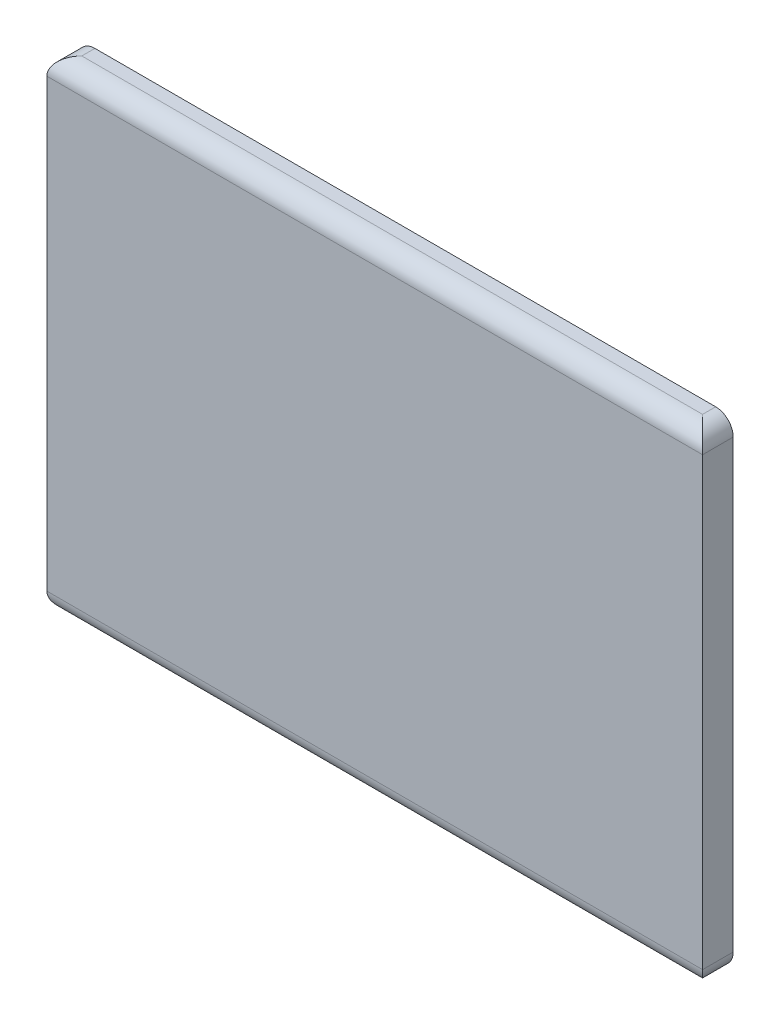
ISO-10303-21;
HEADER;
FILE_DESCRIPTION(('STEP AP214'),'2;1');
FILE_NAME('part.step','',(''),(''),'','','');
FILE_SCHEMA(('AUTOMOTIVE_DESIGN { 1 0 10303 214 1 1 1 1 }'));
ENDSEC;
DATA;
#1=APPLICATION_CONTEXT('core data for automotive mechanical design processes');
#2=APPLICATION_PROTOCOL_DEFINITION('international standard','automotive_design',2000,#1);
#3=PRODUCT_CONTEXT('',#1,'mechanical');
#4=PRODUCT('Part','Part','',(#3));
#5=PRODUCT_RELATED_PRODUCT_CATEGORY('part','',(#4));
#6=PRODUCT_DEFINITION_FORMATION('','',#4);
#7=PRODUCT_DEFINITION_CONTEXT('part definition',#1,'design');
#8=PRODUCT_DEFINITION('design','',#6,#7);
#9=PRODUCT_DEFINITION_SHAPE('','',#8);
#10=(LENGTH_UNIT() NAMED_UNIT(*) SI_UNIT(.MILLI.,.METRE.));
#11=(NAMED_UNIT(*) PLANE_ANGLE_UNIT() SI_UNIT($,.RADIAN.));
#12=(NAMED_UNIT(*) SI_UNIT($,.STERADIAN.) SOLID_ANGLE_UNIT());
#13=UNCERTAINTY_MEASURE_WITH_UNIT(LENGTH_MEASURE(1.E-05),#10,'distance_accuracy_value','');
#14=(GEOMETRIC_REPRESENTATION_CONTEXT(3) GLOBAL_UNCERTAINTY_ASSIGNED_CONTEXT((#13)) GLOBAL_UNIT_ASSIGNED_CONTEXT((#10,
#11,#12)) REPRESENTATION_CONTEXT('',''));
#15=CARTESIAN_POINT('',(0.,0.,0.));
#16=DIRECTION('',(0.,0.,1.));
#17=DIRECTION('',(1.,0.,0.));
#18=AXIS2_PLACEMENT_3D('',#15,#16,#17);
#19=CARTESIAN_POINT('',(0.,0.55,0.));
#20=DIRECTION('',(0.,1.,0.));
#21=DIRECTION('',(1.,0.,0.));
#22=AXIS2_PLACEMENT_3D('',#19,#20,#21);
#23=PLANE('',#22);
#24=DIRECTION('',(0.,0.,1.));
#25=VECTOR('',#24,1.);
#26=CARTESIAN_POINT('',(0.73,0.55,0.));
#27=LINE('',#26,#25);
#28=CARTESIAN_POINT('',(0.73,0.55,0.));
#29=VERTEX_POINT('',#28);
#30=CARTESIAN_POINT('',(0.73,0.55,0.015));
#31=VERTEX_POINT('',#30);
#32=EDGE_CURVE('E161',#29,#31,#27,.T.);
#33=ORIENTED_EDGE('',*,*,#32,.F.);
#34=DIRECTION('',(1.,0.,0.));
#35=VECTOR('',#34,1.);
#36=CARTESIAN_POINT('',(0.,0.55,0.));
#37=LINE('',#36,#35);
#38=CARTESIAN_POINT('',(0.02,0.55,0.));
#39=VERTEX_POINT('',#38);
#40=EDGE_CURVE('E11',#39,#29,#37,.T.);
#41=ORIENTED_EDGE('',*,*,#40,.F.);
#42=DIRECTION('',(0.,0.,-1.));
#43=VECTOR('',#42,1.);
#44=CARTESIAN_POINT('',(0.02,0.55,0.));
#45=LINE('',#44,#43);
#46=CARTESIAN_POINT('',(0.02,0.55,0.015));
#47=VERTEX_POINT('',#46);
#48=EDGE_CURVE('E197',#47,#39,#45,.T.);
#49=ORIENTED_EDGE('',*,*,#48,.F.);
#50=DIRECTION('',(-1.,0.,0.));
#51=VECTOR('',#50,1.);
#52=CARTESIAN_POINT('',(0.,0.55,0.015));
#53=LINE('',#52,#51);
#54=EDGE_CURVE('E146',#31,#47,#53,.T.);
#55=ORIENTED_EDGE('',*,*,#54,.F.);
#56=EDGE_LOOP('',(#33,#41,#49,#55));
#57=FACE_BOUND('',#56,.T.);
#58=ADVANCED_FACE('F17',(#57),#23,.T.);
#59=CARTESIAN_POINT('',(0.,0.,0.));
#60=DIRECTION('',(0.,0.,1.));
#61=DIRECTION('',(1.,0.,0.));
#62=AXIS2_PLACEMENT_3D('',#59,#60,#61);
#63=PLANE('',#62);
#64=CARTESIAN_POINT('',(0.73,0.53,0.));
#65=DIRECTION('',(0.,0.,1.));
#66=DIRECTION('',(0.707106781186548,0.707106781186548,0.));
#67=AXIS2_PLACEMENT_3D('',#64,#65,#66);
#68=CIRCLE('',#67,0.02);
#69=CARTESIAN_POINT('',(0.75,0.53,0.));
#70=VERTEX_POINT('',#69);
#71=EDGE_CURVE('E127',#70,#29,#68,.T.);
#72=ORIENTED_EDGE('',*,*,#71,.F.);
#73=DIRECTION('',(0.,1.,0.));
#74=VECTOR('',#73,1.);
#75=CARTESIAN_POINT('',(0.75,0.,0.));
#76=LINE('',#75,#74);
#77=CARTESIAN_POINT('',(0.75,0.02,0.));
#78=VERTEX_POINT('',#77);
#79=EDGE_CURVE('E69',#78,#70,#76,.T.);
#80=ORIENTED_EDGE('',*,*,#79,.F.);
#81=CARTESIAN_POINT('',(0.73,0.02,0.));
#82=DIRECTION('',(0.,0.,1.));
#83=DIRECTION('',(0.707106781186548,-0.707106781186547,0.));
#84=AXIS2_PLACEMENT_3D('',#81,#82,#83);
#85=CIRCLE('',#84,0.02);
#86=CARTESIAN_POINT('',(0.73,0.,0.));
#87=VERTEX_POINT('',#86);
#88=EDGE_CURVE('E118',#87,#78,#85,.T.);
#89=ORIENTED_EDGE('',*,*,#88,.F.);
#90=DIRECTION('',(1.,0.,0.));
#91=VECTOR('',#90,1.);
#92=CARTESIAN_POINT('',(0.,0.,0.));
#93=LINE('',#92,#91);
#94=CARTESIAN_POINT('',(0.02,0.,0.));
#95=VERTEX_POINT('',#94);
#96=EDGE_CURVE('E28',#95,#87,#93,.T.);
#97=ORIENTED_EDGE('',*,*,#96,.F.);
#98=CARTESIAN_POINT('',(0.02,0.02,0.));
#99=DIRECTION('',(0.,0.,1.));
#100=DIRECTION('',(-0.707106781186548,-0.707106781186548,0.));
#101=AXIS2_PLACEMENT_3D('',#98,#99,#100);
#102=CIRCLE('',#101,0.02);
#103=CARTESIAN_POINT('',(0.,0.02,0.));
#104=VERTEX_POINT('',#103);
#105=EDGE_CURVE('E145',#104,#95,#102,.T.);
#106=ORIENTED_EDGE('',*,*,#105,.F.);
#107=DIRECTION('',(0.,1.,0.));
#108=VECTOR('',#107,1.);
#109=CARTESIAN_POINT('',(0.,0.,0.));
#110=LINE('',#109,#108);
#111=CARTESIAN_POINT('',(0.,0.53,0.));
#112=VERTEX_POINT('',#111);
#113=EDGE_CURVE('E170',#104,#112,#110,.T.);
#114=ORIENTED_EDGE('',*,*,#113,.T.);
#115=CARTESIAN_POINT('',(0.02,0.53,0.));
#116=DIRECTION('',(0.,0.,1.));
#117=DIRECTION('',(-0.707106781186547,0.707106781186548,0.));
#118=AXIS2_PLACEMENT_3D('',#115,#116,#117);
#119=CIRCLE('',#118,0.02);
#120=EDGE_CURVE('E176',#39,#112,#119,.T.);
#121=ORIENTED_EDGE('',*,*,#120,.F.);
#122=ORIENTED_EDGE('',*,*,#40,.T.);
#123=EDGE_LOOP('',(#72,#80,#89,#97,#106,#114,#121,#122));
#124=FACE_BOUND('',#123,.T.);
#125=ADVANCED_FACE('F125',(#124),#63,.F.);
#126=CARTESIAN_POINT('',(0.,0.,0.));
#127=DIRECTION('',(0.,1.,0.));
#128=DIRECTION('',(1.,0.,0.));
#129=AXIS2_PLACEMENT_3D('',#126,#127,#128);
#130=PLANE('',#129);
#131=DIRECTION('',(0.,0.,-1.));
#132=VECTOR('',#131,1.);
#133=CARTESIAN_POINT('',(0.73,0.,0.));
#134=LINE('',#133,#132);
#135=CARTESIAN_POINT('',(0.73,0.,0.015));
#136=VERTEX_POINT('',#135);
#137=EDGE_CURVE('E21',#136,#87,#134,.T.);
#138=ORIENTED_EDGE('',*,*,#137,.F.);
#139=DIRECTION('',(1.,0.,0.));
#140=VECTOR('',#139,1.);
#141=CARTESIAN_POINT('',(0.,0.,0.015));
#142=LINE('',#141,#140);
#143=CARTESIAN_POINT('',(0.02,0.,0.015));
#144=VERTEX_POINT('',#143);
#145=EDGE_CURVE('E42',#144,#136,#142,.T.);
#146=ORIENTED_EDGE('',*,*,#145,.F.);
#147=DIRECTION('',(0.,0.,1.));
#148=VECTOR('',#147,1.);
#149=CARTESIAN_POINT('',(0.02,0.,0.));
#150=LINE('',#149,#148);
#151=EDGE_CURVE('E180',#95,#144,#150,.T.);
#152=ORIENTED_EDGE('',*,*,#151,.F.);
#153=ORIENTED_EDGE('',*,*,#96,.T.);
#154=EDGE_LOOP('',(#138,#146,#152,#153));
#155=FACE_BOUND('',#154,.T.);
#156=ADVANCED_FACE('F241',(#155),#130,.F.);
#157=CARTESIAN_POINT('',(0.,0.02,0.015));
#158=DIRECTION('',(1.,0.,0.));
#159=DIRECTION('',(0.,-0.707106781186548,0.707106781186548));
#160=AXIS2_PLACEMENT_3D('',#157,#158,#159);
#161=CYLINDRICAL_SURFACE('',#160,0.02);
#162=DIRECTION('',(-1.,0.,0.));
#163=VECTOR('',#162,1.);
#164=CARTESIAN_POINT('',(0.,0.02,0.035));
#165=LINE('',#164,#163);
#166=CARTESIAN_POINT('',(0.75,0.02,0.035));
#167=VERTEX_POINT('',#166);
#168=CARTESIAN_POINT('',(0.,0.02,0.035));
#169=VERTEX_POINT('',#168);
#170=EDGE_CURVE('E143',#167,#169,#165,.T.);
#171=ORIENTED_EDGE('',*,*,#170,.T.);
#172=CARTESIAN_POINT('',(0.02,0.02,0.015));
#173=DIRECTION('',(-0.707106781186548,0.,-0.707106781186548));
#174=DIRECTION('',(0.707106781186548,0.,-0.707106781186548));
#175=AXIS2_PLACEMENT_3D('',#172,#173,#174);
#176=ELLIPSE('',#175,0.0282842712474619,0.02);
#177=EDGE_CURVE('E184',#144,#169,#176,.T.);
#178=ORIENTED_EDGE('',*,*,#177,.F.);
#179=ORIENTED_EDGE('',*,*,#145,.T.);
#180=CARTESIAN_POINT('',(0.73,0.02,0.015));
#181=DIRECTION('',(0.707106781186547,0.,-0.707106781186548));
#182=DIRECTION('',(-0.707106781186548,0.,-0.707106781186547));
#183=AXIS2_PLACEMENT_3D('',#180,#181,#182);
#184=ELLIPSE('',#183,0.0282842712474619,0.02);
#185=EDGE_CURVE('E123',#167,#136,#184,.T.);
#186=ORIENTED_EDGE('',*,*,#185,.F.);
#187=EDGE_LOOP('',(#171,#178,#179,#186));
#188=FACE_BOUND('',#187,.T.);
#189=ADVANCED_FACE('F244',(#188),#161,.T.);
#190=CARTESIAN_POINT('',(0.02,0.02,0.));
#191=DIRECTION('',(0.,0.,1.));
#192=DIRECTION('',(-0.707106781186548,-0.707106781186548,0.));
#193=AXIS2_PLACEMENT_3D('',#190,#191,#192);
#194=CYLINDRICAL_SURFACE('',#193,0.02);
#195=DIRECTION('',(0.,0.,-1.));
#196=VECTOR('',#195,1.);
#197=CARTESIAN_POINT('',(0.,0.02,0.));
#198=LINE('',#197,#196);
#199=EDGE_CURVE('E172',#169,#104,#198,.T.);
#200=ORIENTED_EDGE('',*,*,#199,.T.);
#201=ORIENTED_EDGE('',*,*,#105,.T.);
#202=ORIENTED_EDGE('',*,*,#151,.T.);
#203=ORIENTED_EDGE('',*,*,#177,.T.);
#204=EDGE_LOOP('',(#200,#201,#202,#203));
#205=FACE_BOUND('',#204,.T.);
#206=ADVANCED_FACE('F249',(#205),#194,.T.);
#207=CARTESIAN_POINT('',(0.73,0.02,0.));
#208=DIRECTION('',(0.,0.,1.));
#209=DIRECTION('',(0.707106781186548,-0.707106781186547,0.));
#210=AXIS2_PLACEMENT_3D('',#207,#208,#209);
#211=CYLINDRICAL_SURFACE('',#210,0.02);
#212=ORIENTED_EDGE('',*,*,#137,.T.);
#213=ORIENTED_EDGE('',*,*,#88,.T.);
#214=DIRECTION('',(0.,0.,1.));
#215=VECTOR('',#214,1.);
#216=CARTESIAN_POINT('',(0.75,0.02,0.));
#217=LINE('',#216,#215);
#218=EDGE_CURVE('E121',#78,#167,#217,.T.);
#219=ORIENTED_EDGE('',*,*,#218,.T.);
#220=ORIENTED_EDGE('',*,*,#185,.T.);
#221=EDGE_LOOP('',(#212,#213,#219,#220));
#222=FACE_BOUND('',#221,.T.);
#223=ADVANCED_FACE('F119',(#222),#211,.T.);
#224=CARTESIAN_POINT('',(0.,0.,0.));
#225=DIRECTION('',(1.,0.,0.));
#226=DIRECTION('',(0.,1.,0.));
#227=AXIS2_PLACEMENT_3D('',#224,#225,#226);
#228=PLANE('',#227);
#229=DIRECTION('',(0.,0.,1.));
#230=VECTOR('',#229,1.);
#231=CARTESIAN_POINT('',(0.,0.53,0.));
#232=LINE('',#231,#230);
#233=CARTESIAN_POINT('',(0.,0.53,0.035));
#234=VERTEX_POINT('',#233);
#235=EDGE_CURVE('E138',#112,#234,#232,.T.);
#236=ORIENTED_EDGE('',*,*,#235,.F.);
#237=ORIENTED_EDGE('',*,*,#113,.F.);
#238=ORIENTED_EDGE('',*,*,#199,.F.);
#239=DIRECTION('',(0.,1.,0.));
#240=VECTOR('',#239,1.);
#241=CARTESIAN_POINT('',(0.,0.,0.035));
#242=LINE('',#241,#240);
#243=EDGE_CURVE('E130',#169,#234,#242,.T.);
#244=ORIENTED_EDGE('',*,*,#243,.T.);
#245=EDGE_LOOP('',(#236,#237,#238,#244));
#246=FACE_BOUND('',#245,.T.);
#247=ADVANCED_FACE('F218',(#246),#228,.F.);
#248=CARTESIAN_POINT('',(0.,0.,0.035));
#249=DIRECTION('',(0.,0.,1.));
#250=DIRECTION('',(1.,0.,0.));
#251=AXIS2_PLACEMENT_3D('',#248,#249,#250);
#252=PLANE('',#251);
#253=DIRECTION('',(1.,0.,0.));
#254=VECTOR('',#253,1.);
#255=CARTESIAN_POINT('',(0.,0.53,0.035));
#256=LINE('',#255,#254);
#257=CARTESIAN_POINT('',(0.75,0.53,0.035));
#258=VERTEX_POINT('',#257);
#259=EDGE_CURVE('E157',#234,#258,#256,.T.);
#260=ORIENTED_EDGE('',*,*,#259,.F.);
#261=ORIENTED_EDGE('',*,*,#243,.F.);
#262=ORIENTED_EDGE('',*,*,#170,.F.);
#263=DIRECTION('',(0.,1.,0.));
#264=VECTOR('',#263,1.);
#265=CARTESIAN_POINT('',(0.75,0.,0.035));
#266=LINE('',#265,#264);
#267=EDGE_CURVE('E59',#167,#258,#266,.T.);
#268=ORIENTED_EDGE('',*,*,#267,.T.);
#269=EDGE_LOOP('',(#260,#261,#262,#268));
#270=FACE_BOUND('',#269,.T.);
#271=ADVANCED_FACE('F220',(#270),#252,.T.);
#272=CARTESIAN_POINT('',(0.75,0.,0.));
#273=DIRECTION('',(1.,0.,0.));
#274=DIRECTION('',(0.,1.,0.));
#275=AXIS2_PLACEMENT_3D('',#272,#273,#274);
#276=PLANE('',#275);
#277=DIRECTION('',(0.,0.,-1.));
#278=VECTOR('',#277,1.);
#279=CARTESIAN_POINT('',(0.75,0.53,0.));
#280=LINE('',#279,#278);
#281=EDGE_CURVE('E188',#258,#70,#280,.T.);
#282=ORIENTED_EDGE('',*,*,#281,.F.);
#283=ORIENTED_EDGE('',*,*,#267,.F.);
#284=ORIENTED_EDGE('',*,*,#218,.F.);
#285=ORIENTED_EDGE('',*,*,#79,.T.);
#286=EDGE_LOOP('',(#282,#283,#284,#285));
#287=FACE_BOUND('',#286,.T.);
#288=ADVANCED_FACE('F132',(#287),#276,.T.);
#289=CARTESIAN_POINT('',(0.02,0.53,0.));
#290=DIRECTION('',(0.,0.,1.));
#291=DIRECTION('',(-0.707106781186547,0.707106781186548,0.));
#292=AXIS2_PLACEMENT_3D('',#289,#290,#291);
#293=CYLINDRICAL_SURFACE('',#292,0.02);
#294=ORIENTED_EDGE('',*,*,#48,.T.);
#295=ORIENTED_EDGE('',*,*,#120,.T.);
#296=ORIENTED_EDGE('',*,*,#235,.T.);
#297=CARTESIAN_POINT('',(0.02,0.53,0.015));
#298=DIRECTION('',(0.707106781186548,0.,0.707106781186548));
#299=DIRECTION('',(-0.707106781186548,0.,0.707106781186548));
#300=AXIS2_PLACEMENT_3D('',#297,#298,#299);
#301=ELLIPSE('',#300,0.0282842712474619,0.02);
#302=EDGE_CURVE('E149',#47,#234,#301,.T.);
#303=ORIENTED_EDGE('',*,*,#302,.F.);
#304=EDGE_LOOP('',(#294,#295,#296,#303));
#305=FACE_BOUND('',#304,.T.);
#306=ADVANCED_FACE('F19',(#305),#293,.T.);
#307=CARTESIAN_POINT('',(0.,0.53,0.015));
#308=DIRECTION('',(1.,0.,0.));
#309=DIRECTION('',(0.,0.707106781186548,0.707106781186547));
#310=AXIS2_PLACEMENT_3D('',#307,#308,#309);
#311=CYLINDRICAL_SURFACE('',#310,0.02);
#312=ORIENTED_EDGE('',*,*,#54,.T.);
#313=ORIENTED_EDGE('',*,*,#302,.T.);
#314=ORIENTED_EDGE('',*,*,#259,.T.);
#315=CARTESIAN_POINT('',(0.73,0.53,0.015));
#316=DIRECTION('',(0.707106781186547,0.,-0.707106781186548));
#317=DIRECTION('',(-0.707106781186548,0.,-0.707106781186547));
#318=AXIS2_PLACEMENT_3D('',#315,#316,#317);
#319=ELLIPSE('',#318,0.0282842712474619,0.02);
#320=EDGE_CURVE('E150',#31,#258,#319,.T.);
#321=ORIENTED_EDGE('',*,*,#320,.F.);
#322=EDGE_LOOP('',(#312,#313,#314,#321));
#323=FACE_BOUND('',#322,.T.);
#324=ADVANCED_FACE('F221',(#323),#311,.T.);
#325=CARTESIAN_POINT('',(0.73,0.53,0.));
#326=DIRECTION('',(0.,0.,1.));
#327=DIRECTION('',(0.707106781186548,0.707106781186548,0.));
#328=AXIS2_PLACEMENT_3D('',#325,#326,#327);
#329=CYLINDRICAL_SURFACE('',#328,0.02);
#330=ORIENTED_EDGE('',*,*,#281,.T.);
#331=ORIENTED_EDGE('',*,*,#71,.T.);
#332=ORIENTED_EDGE('',*,*,#32,.T.);
#333=ORIENTED_EDGE('',*,*,#320,.T.);
#334=EDGE_LOOP('',(#330,#331,#332,#333));
#335=FACE_BOUND('',#334,.T.);
#336=ADVANCED_FACE('F223',(#335),#329,.T.);
#337=CLOSED_SHELL('',(#58,#125,#156,#189,#206,#223,#247,#271,#288,#306,#324,#336));
#338=MANIFOLD_SOLID_BREP('B1',#337);
#339=ADVANCED_BREP_SHAPE_REPRESENTATION('',(#18,#338),#14);
#340=SHAPE_DEFINITION_REPRESENTATION(#9,#339);
ENDSEC;
END-ISO-10303-21;
